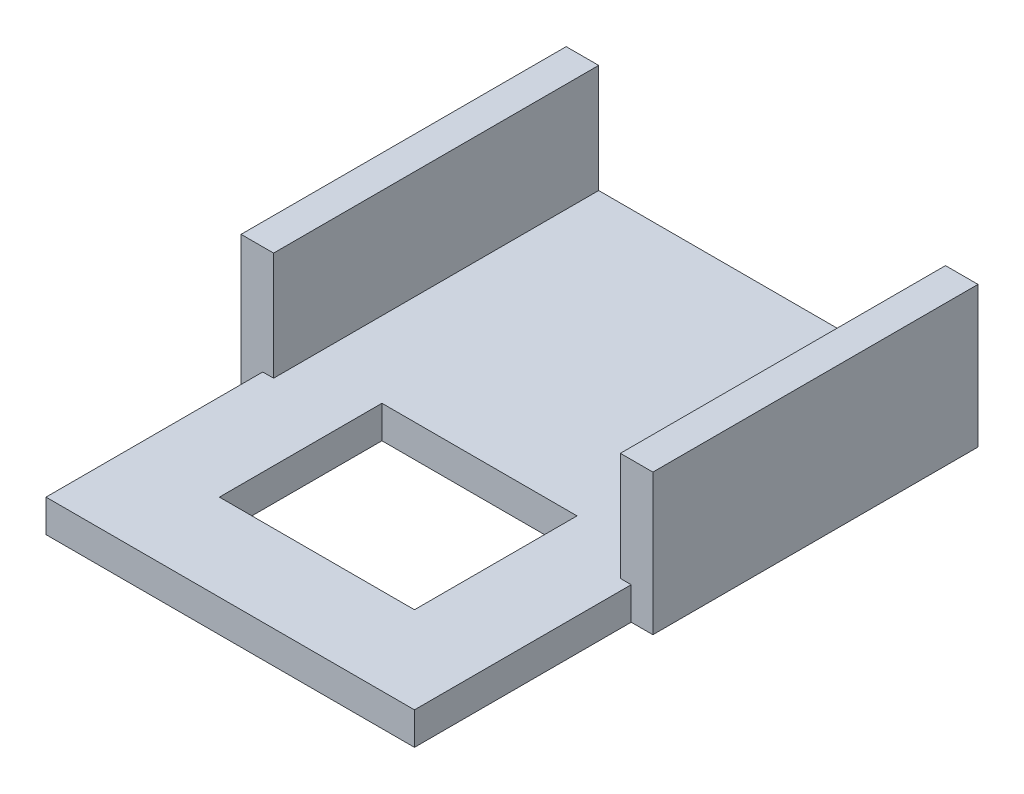
ISO-10303-21;
HEADER;
FILE_DESCRIPTION(('STEP AP214'),'2;1');
FILE_NAME('part.step','',(''),(''),'','','');
FILE_SCHEMA(('AUTOMOTIVE_DESIGN { 1 0 10303 214 1 1 1 1 }'));
ENDSEC;
DATA;
#1=APPLICATION_CONTEXT('core data for automotive mechanical design processes');
#2=APPLICATION_PROTOCOL_DEFINITION('international standard','automotive_design',2000,#1);
#3=PRODUCT_CONTEXT('',#1,'mechanical');
#4=PRODUCT('Part','Part','',(#3));
#5=PRODUCT_RELATED_PRODUCT_CATEGORY('part','',(#4));
#6=PRODUCT_DEFINITION_FORMATION('','',#4);
#7=PRODUCT_DEFINITION_CONTEXT('part definition',#1,'design');
#8=PRODUCT_DEFINITION('design','',#6,#7);
#9=PRODUCT_DEFINITION_SHAPE('','',#8);
#10=(LENGTH_UNIT() NAMED_UNIT(*) SI_UNIT(.MILLI.,.METRE.));
#11=(NAMED_UNIT(*) PLANE_ANGLE_UNIT() SI_UNIT($,.RADIAN.));
#12=(NAMED_UNIT(*) SI_UNIT($,.STERADIAN.) SOLID_ANGLE_UNIT());
#13=UNCERTAINTY_MEASURE_WITH_UNIT(LENGTH_MEASURE(1.E-05),#10,'distance_accuracy_value','');
#14=(GEOMETRIC_REPRESENTATION_CONTEXT(3) GLOBAL_UNCERTAINTY_ASSIGNED_CONTEXT((#13)) GLOBAL_UNIT_ASSIGNED_CONTEXT((#10,
#11,#12)) REPRESENTATION_CONTEXT('',''));
#15=CARTESIAN_POINT('',(0.,0.,0.));
#16=DIRECTION('',(0.,0.,1.));
#17=DIRECTION('',(1.,0.,0.));
#18=AXIS2_PLACEMENT_3D('',#15,#16,#17);
#19=CARTESIAN_POINT('',(-1.9,0.65,3.));
#20=DIRECTION('',(0.,0.,-1.));
#21=DIRECTION('',(-1.,0.,0.));
#22=AXIS2_PLACEMENT_3D('',#19,#20,#21);
#23=PLANE('',#22);
#24=DIRECTION('',(0.,-1.,0.));
#25=VECTOR('',#24,1.);
#26=CARTESIAN_POINT('',(-1.70000000000002,-0.350000000000036,3.));
#27=LINE('',#26,#25);
#28=CARTESIAN_POINT('',(-1.70000000000002,-0.350000000000036,3.));
#29=VERTEX_POINT('',#28);
#30=CARTESIAN_POINT('',(-1.70000000000001,-0.65,3.));
#31=VERTEX_POINT('',#30);
#32=EDGE_CURVE('E170',#29,#31,#27,.T.);
#33=ORIENTED_EDGE('',*,*,#32,.F.);
#34=DIRECTION('',(-1.,0.,0.));
#35=VECTOR('',#34,1.);
#36=CARTESIAN_POINT('',(1.70000000000002,-0.350000000000036,3.));
#37=LINE('',#36,#35);
#38=CARTESIAN_POINT('',(-1.60000000000002,-0.35,3.));
#39=VERTEX_POINT('',#38);
#40=EDGE_CURVE('E185',#39,#29,#37,.T.);
#41=ORIENTED_EDGE('',*,*,#40,.F.);
#42=DIRECTION('',(0.,1.,0.));
#43=VECTOR('',#42,1.);
#44=CARTESIAN_POINT('',(-1.6,0.65,3.));
#45=LINE('',#44,#43);
#46=CARTESIAN_POINT('',(-1.6,0.65,3.));
#47=VERTEX_POINT('',#46);
#48=EDGE_CURVE('E254',#39,#47,#45,.T.);
#49=ORIENTED_EDGE('',*,*,#48,.T.);
#50=DIRECTION('',(-1.,0.,0.));
#51=VECTOR('',#50,1.);
#52=CARTESIAN_POINT('',(-1.9,0.65,3.));
#53=LINE('',#52,#51);
#54=CARTESIAN_POINT('',(-1.9,0.65,3.));
#55=VERTEX_POINT('',#54);
#56=EDGE_CURVE('E253',#47,#55,#53,.T.);
#57=ORIENTED_EDGE('',*,*,#56,.T.);
#58=DIRECTION('',(0.,-1.,0.));
#59=VECTOR('',#58,1.);
#60=CARTESIAN_POINT('',(-1.9,-0.65,3.));
#61=LINE('',#60,#59);
#62=CARTESIAN_POINT('',(-1.9,-0.65,3.));
#63=VERTEX_POINT('',#62);
#64=EDGE_CURVE('E226',#55,#63,#61,.T.);
#65=ORIENTED_EDGE('',*,*,#64,.T.);
#66=DIRECTION('',(1.,0.,0.));
#67=VECTOR('',#66,1.);
#68=CARTESIAN_POINT('',(1.9,-0.65,3.));
#69=LINE('',#68,#67);
#70=EDGE_CURVE('E233',#63,#31,#69,.T.);
#71=ORIENTED_EDGE('',*,*,#70,.T.);
#72=EDGE_LOOP('',(#33,#41,#49,#57,#65,#71));
#73=FACE_BOUND('',#72,.T.);
#74=ADVANCED_FACE('F33',(#73),#23,.F.);
#75=CARTESIAN_POINT('',(1.70000000000002,-0.350000000000036,3.));
#76=VERTEX_POINT('',#75);
#77=CARTESIAN_POINT('',(1.60000000000002,-0.350000000000036,3.));
#78=VERTEX_POINT('',#77);
#79=EDGE_CURVE('E202',#76,#78,#37,.T.);
#80=ORIENTED_EDGE('',*,*,#79,.F.);
#81=DIRECTION('',(0.,1.,0.));
#82=VECTOR('',#81,1.);
#83=CARTESIAN_POINT('',(1.70000000000002,-0.350000000000036,3.));
#84=LINE('',#83,#82);
#85=CARTESIAN_POINT('',(1.70000000000001,-0.65,3.));
#86=VERTEX_POINT('',#85);
#87=EDGE_CURVE('E182',#86,#76,#84,.T.);
#88=ORIENTED_EDGE('',*,*,#87,.F.);
#89=CARTESIAN_POINT('',(1.9,-0.65,3.));
#90=VERTEX_POINT('',#89);
#91=EDGE_CURVE('E196',#86,#90,#69,.T.);
#92=ORIENTED_EDGE('',*,*,#91,.T.);
#93=DIRECTION('',(0.,1.,0.));
#94=VECTOR('',#93,1.);
#95=CARTESIAN_POINT('',(1.9,0.65,3.));
#96=LINE('',#95,#94);
#97=CARTESIAN_POINT('',(1.9,0.65,3.));
#98=VERTEX_POINT('',#97);
#99=EDGE_CURVE('E230',#90,#98,#96,.T.);
#100=ORIENTED_EDGE('',*,*,#99,.T.);
#101=DIRECTION('',(-1.,0.,0.));
#102=VECTOR('',#101,1.);
#103=CARTESIAN_POINT('',(1.9,0.65,3.));
#104=LINE('',#103,#102);
#105=CARTESIAN_POINT('',(1.6,0.65,3.));
#106=VERTEX_POINT('',#105);
#107=EDGE_CURVE('E255',#98,#106,#104,.T.);
#108=ORIENTED_EDGE('',*,*,#107,.T.);
#109=DIRECTION('',(0.,-1.,0.));
#110=VECTOR('',#109,1.);
#111=CARTESIAN_POINT('',(1.6,0.65,3.));
#112=LINE('',#111,#110);
#113=EDGE_CURVE('E256',#106,#78,#112,.T.);
#114=ORIENTED_EDGE('',*,*,#113,.T.);
#115=EDGE_LOOP('',(#80,#88,#92,#100,#108,#114));
#116=FACE_BOUND('',#115,.T.);
#117=ADVANCED_FACE('F263',(#116),#23,.F.);
#118=CARTESIAN_POINT('',(-1.9,-0.65,3.));
#119=DIRECTION('',(1.,0.,0.));
#120=DIRECTION('',(0.,0.,-1.));
#121=AXIS2_PLACEMENT_3D('',#118,#119,#120);
#122=PLANE('',#121);
#123=DIRECTION('',(0.,-1.,0.));
#124=VECTOR('',#123,1.);
#125=CARTESIAN_POINT('',(-1.9,-0.65,0.));
#126=LINE('',#125,#124);
#127=CARTESIAN_POINT('',(-1.9,0.65,0.));
#128=VERTEX_POINT('',#127);
#129=CARTESIAN_POINT('',(-1.9,-0.65,0.));
#130=VERTEX_POINT('',#129);
#131=EDGE_CURVE('E208',#128,#130,#126,.T.);
#132=ORIENTED_EDGE('',*,*,#131,.T.);
#133=DIRECTION('',(0.,0.,-1.));
#134=VECTOR('',#133,1.);
#135=CARTESIAN_POINT('',(-1.9,-0.65,3.));
#136=LINE('',#135,#134);
#137=EDGE_CURVE('E190',#63,#130,#136,.T.);
#138=ORIENTED_EDGE('',*,*,#137,.F.);
#139=ORIENTED_EDGE('',*,*,#64,.F.);
#140=DIRECTION('',(0.,0.,-1.));
#141=VECTOR('',#140,1.);
#142=CARTESIAN_POINT('',(-1.9,0.65,3.));
#143=LINE('',#142,#141);
#144=EDGE_CURVE('E250',#55,#128,#143,.T.);
#145=ORIENTED_EDGE('',*,*,#144,.T.);
#146=EDGE_LOOP('',(#132,#138,#139,#145));
#147=FACE_BOUND('',#146,.T.);
#148=ADVANCED_FACE('F35',(#147),#122,.F.);
#149=CARTESIAN_POINT('',(1.9,-0.65,3.));
#150=DIRECTION('',(0.,1.,0.));
#151=DIRECTION('',(0.,0.,1.));
#152=AXIS2_PLACEMENT_3D('',#149,#150,#151);
#153=PLANE('',#152);
#154=DIRECTION('',(0.,0.,-1.));
#155=VECTOR('',#154,1.);
#156=CARTESIAN_POINT('',(-0.9,-0.65,4.19999999999999));
#157=LINE('',#156,#155);
#158=CARTESIAN_POINT('',(-0.9,-0.65,4.19999999999999));
#159=VERTEX_POINT('',#158);
#160=CARTESIAN_POINT('',(-0.899999999999999,-0.65,2.69999999999999));
#161=VERTEX_POINT('',#160);
#162=EDGE_CURVE('E48',#159,#161,#157,.T.);
#163=ORIENTED_EDGE('',*,*,#162,.F.);
#164=DIRECTION('',(-1.,0.,0.));
#165=VECTOR('',#164,1.);
#166=CARTESIAN_POINT('',(-0.9,-0.65,4.19999999999999));
#167=LINE('',#166,#165);
#168=CARTESIAN_POINT('',(0.9,-0.65,4.19999999999999));
#169=VERTEX_POINT('',#168);
#170=EDGE_CURVE('E152',#169,#159,#167,.T.);
#171=ORIENTED_EDGE('',*,*,#170,.F.);
#172=DIRECTION('',(0.,0.,1.));
#173=VECTOR('',#172,1.);
#174=CARTESIAN_POINT('',(0.9,-0.65,4.19999999999999));
#175=LINE('',#174,#173);
#176=CARTESIAN_POINT('',(0.900000000000006,-0.65,2.69999999999996));
#177=VERTEX_POINT('',#176);
#178=EDGE_CURVE('E149',#177,#169,#175,.T.);
#179=ORIENTED_EDGE('',*,*,#178,.F.);
#180=DIRECTION('',(1.,0.,0.));
#181=VECTOR('',#180,1.);
#182=CARTESIAN_POINT('',(0.900000000000006,-0.65,2.69999999999996));
#183=LINE('',#182,#181);
#184=EDGE_CURVE('E164',#161,#177,#183,.T.);
#185=ORIENTED_EDGE('',*,*,#184,.F.);
#186=EDGE_LOOP('',(#163,#171,#179,#185));
#187=FACE_BOUND('',#186,.T.);
#188=DIRECTION('',(1.,0.,0.));
#189=VECTOR('',#188,1.);
#190=CARTESIAN_POINT('',(1.9,-0.65,0.));
#191=LINE('',#190,#189);
#192=CARTESIAN_POINT('',(1.9,-0.65,0.));
#193=VERTEX_POINT('',#192);
#194=EDGE_CURVE('E211',#130,#193,#191,.T.);
#195=ORIENTED_EDGE('',*,*,#194,.T.);
#196=DIRECTION('',(0.,0.,-1.));
#197=VECTOR('',#196,1.);
#198=CARTESIAN_POINT('',(1.9,-0.65,3.));
#199=LINE('',#198,#197);
#200=EDGE_CURVE('E237',#90,#193,#199,.T.);
#201=ORIENTED_EDGE('',*,*,#200,.F.);
#202=ORIENTED_EDGE('',*,*,#91,.F.);
#203=DIRECTION('',(0.,0.,-1.));
#204=VECTOR('',#203,1.);
#205=CARTESIAN_POINT('',(1.7,-0.65,5.));
#206=LINE('',#205,#204);
#207=CARTESIAN_POINT('',(1.7,-0.65,5.));
#208=VERTEX_POINT('',#207);
#209=EDGE_CURVE('E288',#208,#86,#206,.T.);
#210=ORIENTED_EDGE('',*,*,#209,.F.);
#211=DIRECTION('',(1.,0.,0.));
#212=VECTOR('',#211,1.);
#213=CARTESIAN_POINT('',(-1.7,-0.65,5.));
#214=LINE('',#213,#212);
#215=CARTESIAN_POINT('',(-1.7,-0.65,5.));
#216=VERTEX_POINT('',#215);
#217=EDGE_CURVE('E300',#216,#208,#214,.T.);
#218=ORIENTED_EDGE('',*,*,#217,.F.);
#219=DIRECTION('',(0.,0.,-1.));
#220=VECTOR('',#219,1.);
#221=CARTESIAN_POINT('',(-1.7,-0.65,5.));
#222=LINE('',#221,#220);
#223=EDGE_CURVE('E212',#216,#31,#222,.T.);
#224=ORIENTED_EDGE('',*,*,#223,.T.);
#225=ORIENTED_EDGE('',*,*,#70,.F.);
#226=ORIENTED_EDGE('',*,*,#137,.T.);
#227=EDGE_LOOP('',(#195,#201,#202,#210,#218,#224,#225,#226));
#228=FACE_BOUND('',#227,.T.);
#229=ADVANCED_FACE('F161',(#187,#228),#153,.F.);
#230=CARTESIAN_POINT('',(1.9,0.65,3.));
#231=DIRECTION('',(-1.,0.,0.));
#232=DIRECTION('',(0.,0.,1.));
#233=AXIS2_PLACEMENT_3D('',#230,#231,#232);
#234=PLANE('',#233);
#235=DIRECTION('',(0.,1.,0.));
#236=VECTOR('',#235,1.);
#237=CARTESIAN_POINT('',(1.9,0.65,0.));
#238=LINE('',#237,#236);
#239=CARTESIAN_POINT('',(1.9,0.65,0.));
#240=VERTEX_POINT('',#239);
#241=EDGE_CURVE('E214',#193,#240,#238,.T.);
#242=ORIENTED_EDGE('',*,*,#241,.T.);
#243=DIRECTION('',(0.,0.,-1.));
#244=VECTOR('',#243,1.);
#245=CARTESIAN_POINT('',(1.9,0.65,3.));
#246=LINE('',#245,#244);
#247=EDGE_CURVE('E240',#98,#240,#246,.T.);
#248=ORIENTED_EDGE('',*,*,#247,.F.);
#249=ORIENTED_EDGE('',*,*,#99,.F.);
#250=ORIENTED_EDGE('',*,*,#200,.T.);
#251=EDGE_LOOP('',(#242,#248,#249,#250));
#252=FACE_BOUND('',#251,.T.);
#253=ADVANCED_FACE('F267',(#252),#234,.F.);
#254=CARTESIAN_POINT('',(1.9,0.65,3.));
#255=DIRECTION('',(0.,-1.,0.));
#256=DIRECTION('',(0.,0.,-1.));
#257=AXIS2_PLACEMENT_3D('',#254,#255,#256);
#258=PLANE('',#257);
#259=DIRECTION('',(-1.,0.,0.));
#260=VECTOR('',#259,1.);
#261=CARTESIAN_POINT('',(1.9,0.65,0.));
#262=LINE('',#261,#260);
#263=CARTESIAN_POINT('',(1.6,0.65,0.));
#264=VERTEX_POINT('',#263);
#265=EDGE_CURVE('E216',#240,#264,#262,.T.);
#266=ORIENTED_EDGE('',*,*,#265,.T.);
#267=DIRECTION('',(0.,0.,-1.));
#268=VECTOR('',#267,1.);
#269=CARTESIAN_POINT('',(1.6,0.65,3.));
#270=LINE('',#269,#268);
#271=EDGE_CURVE('E243',#106,#264,#270,.T.);
#272=ORIENTED_EDGE('',*,*,#271,.F.);
#273=ORIENTED_EDGE('',*,*,#107,.F.);
#274=ORIENTED_EDGE('',*,*,#247,.T.);
#275=EDGE_LOOP('',(#266,#272,#273,#274));
#276=FACE_BOUND('',#275,.T.);
#277=ADVANCED_FACE('F271',(#276),#258,.F.);
#278=CARTESIAN_POINT('',(1.6,0.65,3.));
#279=DIRECTION('',(1.,0.,0.));
#280=DIRECTION('',(0.,1.,0.));
#281=AXIS2_PLACEMENT_3D('',#278,#279,#280);
#282=PLANE('',#281);
#283=DIRECTION('',(0.,-1.,0.));
#284=VECTOR('',#283,1.);
#285=CARTESIAN_POINT('',(1.6,0.65,0.));
#286=LINE('',#285,#284);
#287=CARTESIAN_POINT('',(1.60000000000002,-0.350000000000036,0.));
#288=VERTEX_POINT('',#287);
#289=EDGE_CURVE('E218',#264,#288,#286,.T.);
#290=ORIENTED_EDGE('',*,*,#289,.T.);
#291=DIRECTION('',(0.,0.,-1.));
#292=VECTOR('',#291,1.);
#293=CARTESIAN_POINT('',(1.60000000000002,-0.350000000000036,3.));
#294=LINE('',#293,#292);
#295=EDGE_CURVE('E246',#78,#288,#294,.T.);
#296=ORIENTED_EDGE('',*,*,#295,.F.);
#297=ORIENTED_EDGE('',*,*,#113,.F.);
#298=ORIENTED_EDGE('',*,*,#271,.T.);
#299=EDGE_LOOP('',(#290,#296,#297,#298));
#300=FACE_BOUND('',#299,.T.);
#301=ADVANCED_FACE('F276',(#300),#282,.F.);
#302=CARTESIAN_POINT('',(1.60000000000002,-0.350000000000036,3.));
#303=DIRECTION('',(0.,-1.,0.));
#304=DIRECTION('',(1.,0.,0.));
#305=AXIS2_PLACEMENT_3D('',#302,#303,#304);
#306=PLANE('',#305);
#307=DIRECTION('',(1.,0.,0.));
#308=VECTOR('',#307,1.);
#309=CARTESIAN_POINT('',(1.60000000000002,-0.350000000000036,2.69999999999995));
#310=LINE('',#309,#308);
#311=CARTESIAN_POINT('',(-0.9,-0.350000000000007,2.69999999999999));
#312=VERTEX_POINT('',#311);
#313=CARTESIAN_POINT('',(0.900000000000006,-0.350000000000018,2.69999999999996));
#314=VERTEX_POINT('',#313);
#315=EDGE_CURVE('E41',#312,#314,#310,.T.);
#316=ORIENTED_EDGE('',*,*,#315,.T.);
#317=DIRECTION('',(0.,0.,1.));
#318=VECTOR('',#317,1.);
#319=CARTESIAN_POINT('',(0.900000000000005,-0.350000000000028,3.));
#320=LINE('',#319,#318);
#321=CARTESIAN_POINT('',(0.9,-0.350000000000018,4.19999999999999));
#322=VERTEX_POINT('',#321);
#323=EDGE_CURVE('E11',#314,#322,#320,.T.);
#324=ORIENTED_EDGE('',*,*,#323,.T.);
#325=DIRECTION('',(-1.,0.,0.));
#326=VECTOR('',#325,1.);
#327=CARTESIAN_POINT('',(1.60000000000002,-0.350000000000036,4.19999999999999));
#328=LINE('',#327,#326);
#329=CARTESIAN_POINT('',(-0.9,-0.350000000000008,4.19999999999999));
#330=VERTEX_POINT('',#329);
#331=EDGE_CURVE('E189',#322,#330,#328,.T.);
#332=ORIENTED_EDGE('',*,*,#331,.T.);
#333=DIRECTION('',(0.,0.,-1.));
#334=VECTOR('',#333,1.);
#335=CARTESIAN_POINT('',(-0.9,-0.350000000000008,3.));
#336=LINE('',#335,#334);
#337=EDGE_CURVE('E146',#330,#312,#336,.T.);
#338=ORIENTED_EDGE('',*,*,#337,.T.);
#339=EDGE_LOOP('',(#316,#324,#332,#338));
#340=FACE_BOUND('',#339,.T.);
#341=DIRECTION('',(-1.,0.,0.));
#342=VECTOR('',#341,1.);
#343=CARTESIAN_POINT('',(1.60000000000002,-0.350000000000036,0.));
#344=LINE('',#343,#342);
#345=CARTESIAN_POINT('',(-1.60000000000002,-0.35,0.));
#346=VERTEX_POINT('',#345);
#347=EDGE_CURVE('E220',#288,#346,#344,.T.);
#348=ORIENTED_EDGE('',*,*,#347,.T.);
#349=DIRECTION('',(0.,0.,-1.));
#350=VECTOR('',#349,1.);
#351=CARTESIAN_POINT('',(-1.60000000000002,-0.35,3.));
#352=LINE('',#351,#350);
#353=EDGE_CURVE('E191',#39,#346,#352,.T.);
#354=ORIENTED_EDGE('',*,*,#353,.F.);
#355=ORIENTED_EDGE('',*,*,#40,.T.);
#356=DIRECTION('',(0.,0.,-1.));
#357=VECTOR('',#356,1.);
#358=CARTESIAN_POINT('',(-1.70000000000002,-0.350000000000036,5.));
#359=LINE('',#358,#357);
#360=CARTESIAN_POINT('',(-1.70000000000002,-0.350000000000036,5.));
#361=VERTEX_POINT('',#360);
#362=EDGE_CURVE('E292',#361,#29,#359,.T.);
#363=ORIENTED_EDGE('',*,*,#362,.F.);
#364=DIRECTION('',(-1.,0.,0.));
#365=VECTOR('',#364,1.);
#366=CARTESIAN_POINT('',(1.70000000000002,-0.350000000000036,5.));
#367=LINE('',#366,#365);
#368=CARTESIAN_POINT('',(1.70000000000002,-0.350000000000036,5.));
#369=VERTEX_POINT('',#368);
#370=EDGE_CURVE('E291',#369,#361,#367,.T.);
#371=ORIENTED_EDGE('',*,*,#370,.F.);
#372=DIRECTION('',(0.,0.,-1.));
#373=VECTOR('',#372,1.);
#374=CARTESIAN_POINT('',(1.70000000000002,-0.350000000000036,5.));
#375=LINE('',#374,#373);
#376=EDGE_CURVE('E206',#369,#76,#375,.T.);
#377=ORIENTED_EDGE('',*,*,#376,.T.);
#378=ORIENTED_EDGE('',*,*,#79,.T.);
#379=ORIENTED_EDGE('',*,*,#295,.T.);
#380=EDGE_LOOP('',(#348,#354,#355,#363,#371,#377,#378,#379));
#381=FACE_BOUND('',#380,.T.);
#382=ADVANCED_FACE('F289',(#340,#381),#306,.F.);
#383=CARTESIAN_POINT('',(-1.6,0.65,3.));
#384=DIRECTION('',(-1.,0.,0.));
#385=DIRECTION('',(0.,-1.,0.));
#386=AXIS2_PLACEMENT_3D('',#383,#384,#385);
#387=PLANE('',#386);
#388=DIRECTION('',(0.,1.,0.));
#389=VECTOR('',#388,1.);
#390=CARTESIAN_POINT('',(-1.6,0.65,0.));
#391=LINE('',#390,#389);
#392=CARTESIAN_POINT('',(-1.6,0.65,0.));
#393=VERTEX_POINT('',#392);
#394=EDGE_CURVE('E222',#346,#393,#391,.T.);
#395=ORIENTED_EDGE('',*,*,#394,.T.);
#396=DIRECTION('',(0.,0.,-1.));
#397=VECTOR('',#396,1.);
#398=CARTESIAN_POINT('',(-1.6,0.65,3.));
#399=LINE('',#398,#397);
#400=EDGE_CURVE('E247',#47,#393,#399,.T.);
#401=ORIENTED_EDGE('',*,*,#400,.F.);
#402=ORIENTED_EDGE('',*,*,#48,.F.);
#403=ORIENTED_EDGE('',*,*,#353,.T.);
#404=EDGE_LOOP('',(#395,#401,#402,#403));
#405=FACE_BOUND('',#404,.T.);
#406=ADVANCED_FACE('F352',(#405),#387,.F.);
#407=CARTESIAN_POINT('',(-1.9,0.65,3.));
#408=DIRECTION('',(0.,-1.,0.));
#409=DIRECTION('',(0.,0.,-1.));
#410=AXIS2_PLACEMENT_3D('',#407,#408,#409);
#411=PLANE('',#410);
#412=DIRECTION('',(-1.,0.,0.));
#413=VECTOR('',#412,1.);
#414=CARTESIAN_POINT('',(-1.9,0.65,0.));
#415=LINE('',#414,#413);
#416=EDGE_CURVE('E224',#393,#128,#415,.T.);
#417=ORIENTED_EDGE('',*,*,#416,.T.);
#418=ORIENTED_EDGE('',*,*,#144,.F.);
#419=ORIENTED_EDGE('',*,*,#56,.F.);
#420=ORIENTED_EDGE('',*,*,#400,.T.);
#421=EDGE_LOOP('',(#417,#418,#419,#420));
#422=FACE_BOUND('',#421,.T.);
#423=ADVANCED_FACE('F349',(#422),#411,.F.);
#424=CARTESIAN_POINT('',(-1.9,0.65,0.));
#425=DIRECTION('',(0.,0.,-1.));
#426=DIRECTION('',(-1.,0.,0.));
#427=AXIS2_PLACEMENT_3D('',#424,#425,#426);
#428=PLANE('',#427);
#429=ORIENTED_EDGE('',*,*,#131,.F.);
#430=ORIENTED_EDGE('',*,*,#416,.F.);
#431=ORIENTED_EDGE('',*,*,#394,.F.);
#432=ORIENTED_EDGE('',*,*,#347,.F.);
#433=ORIENTED_EDGE('',*,*,#289,.F.);
#434=ORIENTED_EDGE('',*,*,#265,.F.);
#435=ORIENTED_EDGE('',*,*,#241,.F.);
#436=ORIENTED_EDGE('',*,*,#194,.F.);
#437=EDGE_LOOP('',(#429,#430,#431,#432,#433,#434,#435,#436));
#438=FACE_BOUND('',#437,.T.);
#439=ADVANCED_FACE('F312',(#438),#428,.T.);
#440=CARTESIAN_POINT('',(-1.70000000000002,-0.350000000000036,5.));
#441=DIRECTION('',(1.,0.,0.));
#442=DIRECTION('',(0.,1.,0.));
#443=AXIS2_PLACEMENT_3D('',#440,#441,#442);
#444=PLANE('',#443);
#445=ORIENTED_EDGE('',*,*,#32,.T.);
#446=ORIENTED_EDGE('',*,*,#223,.F.);
#447=DIRECTION('',(0.,-1.,0.));
#448=VECTOR('',#447,1.);
#449=CARTESIAN_POINT('',(-1.70000000000002,-0.350000000000036,5.));
#450=LINE('',#449,#448);
#451=EDGE_CURVE('E176',#361,#216,#450,.T.);
#452=ORIENTED_EDGE('',*,*,#451,.F.);
#453=ORIENTED_EDGE('',*,*,#362,.T.);
#454=EDGE_LOOP('',(#445,#446,#452,#453));
#455=FACE_BOUND('',#454,.T.);
#456=ADVANCED_FACE('F306',(#455),#444,.F.);
#457=CARTESIAN_POINT('',(1.70000000000002,-0.350000000000036,5.));
#458=DIRECTION('',(-1.,0.,0.));
#459=DIRECTION('',(0.,-1.,0.));
#460=AXIS2_PLACEMENT_3D('',#457,#458,#459);
#461=PLANE('',#460);
#462=ORIENTED_EDGE('',*,*,#87,.T.);
#463=ORIENTED_EDGE('',*,*,#376,.F.);
#464=DIRECTION('',(0.,1.,0.));
#465=VECTOR('',#464,1.);
#466=CARTESIAN_POINT('',(1.70000000000002,-0.350000000000036,5.));
#467=LINE('',#466,#465);
#468=EDGE_CURVE('E297',#208,#369,#467,.T.);
#469=ORIENTED_EDGE('',*,*,#468,.F.);
#470=ORIENTED_EDGE('',*,*,#209,.T.);
#471=EDGE_LOOP('',(#462,#463,#469,#470));
#472=FACE_BOUND('',#471,.T.);
#473=ADVANCED_FACE('F284',(#472),#461,.F.);
#474=CARTESIAN_POINT('',(-1.70000000000002,-0.350000000000036,5.));
#475=DIRECTION('',(0.,0.,-1.));
#476=DIRECTION('',(-1.,0.,0.));
#477=AXIS2_PLACEMENT_3D('',#474,#475,#476);
#478=PLANE('',#477);
#479=ORIENTED_EDGE('',*,*,#451,.T.);
#480=ORIENTED_EDGE('',*,*,#217,.T.);
#481=ORIENTED_EDGE('',*,*,#468,.T.);
#482=ORIENTED_EDGE('',*,*,#370,.T.);
#483=EDGE_LOOP('',(#479,#480,#481,#482));
#484=FACE_BOUND('',#483,.T.);
#485=ADVANCED_FACE('F304',(#484),#478,.F.);
#486=CARTESIAN_POINT('',(0.9,1.35,4.19999999999999));
#487=DIRECTION('',(1.,0.,0.));
#488=DIRECTION('',(0.,0.,-1.));
#489=AXIS2_PLACEMENT_3D('',#486,#487,#488);
#490=PLANE('',#489);
#491=DIRECTION('',(0.,-1.,0.));
#492=VECTOR('',#491,1.);
#493=CARTESIAN_POINT('',(0.900000000000006,1.35,2.69999999999996));
#494=LINE('',#493,#492);
#495=EDGE_CURVE('E171',#314,#177,#494,.T.);
#496=ORIENTED_EDGE('',*,*,#495,.T.);
#497=ORIENTED_EDGE('',*,*,#178,.T.);
#498=DIRECTION('',(0.,-1.,0.));
#499=VECTOR('',#498,1.);
#500=CARTESIAN_POINT('',(0.9,1.35,4.19999999999999));
#501=LINE('',#500,#499);
#502=EDGE_CURVE('E155',#322,#169,#501,.T.);
#503=ORIENTED_EDGE('',*,*,#502,.F.);
#504=ORIENTED_EDGE('',*,*,#323,.F.);
#505=EDGE_LOOP('',(#496,#497,#503,#504));
#506=FACE_BOUND('',#505,.T.);
#507=ADVANCED_FACE('F330',(#506),#490,.F.);
#508=CARTESIAN_POINT('',(-0.9,1.35,4.19999999999999));
#509=DIRECTION('',(-1.,0.,0.));
#510=DIRECTION('',(0.,0.,1.));
#511=AXIS2_PLACEMENT_3D('',#508,#509,#510);
#512=PLANE('',#511);
#513=DIRECTION('',(0.,-1.,0.));
#514=VECTOR('',#513,1.);
#515=CARTESIAN_POINT('',(-0.9,1.35,4.19999999999999));
#516=LINE('',#515,#514);
#517=EDGE_CURVE('E55',#330,#159,#516,.T.);
#518=ORIENTED_EDGE('',*,*,#517,.T.);
#519=ORIENTED_EDGE('',*,*,#162,.T.);
#520=DIRECTION('',(0.,-1.,0.));
#521=VECTOR('',#520,1.);
#522=CARTESIAN_POINT('',(-0.9,1.35,2.69999999999999));
#523=LINE('',#522,#521);
#524=EDGE_CURVE('E148',#312,#161,#523,.T.);
#525=ORIENTED_EDGE('',*,*,#524,.F.);
#526=ORIENTED_EDGE('',*,*,#337,.F.);
#527=EDGE_LOOP('',(#518,#519,#525,#526));
#528=FACE_BOUND('',#527,.T.);
#529=ADVANCED_FACE('F144',(#528),#512,.F.);
#530=CARTESIAN_POINT('',(0.900000000000006,1.35,2.69999999999996));
#531=DIRECTION('',(0.,0.,-1.));
#532=DIRECTION('',(-1.,0.,0.));
#533=AXIS2_PLACEMENT_3D('',#530,#531,#532);
#534=PLANE('',#533);
#535=ORIENTED_EDGE('',*,*,#524,.T.);
#536=ORIENTED_EDGE('',*,*,#184,.T.);
#537=ORIENTED_EDGE('',*,*,#495,.F.);
#538=ORIENTED_EDGE('',*,*,#315,.F.);
#539=EDGE_LOOP('',(#535,#536,#537,#538));
#540=FACE_BOUND('',#539,.T.);
#541=ADVANCED_FACE('F328',(#540),#534,.F.);
#542=CARTESIAN_POINT('',(-0.9,1.35,4.19999999999999));
#543=DIRECTION('',(0.,0.,1.));
#544=DIRECTION('',(1.,0.,0.));
#545=AXIS2_PLACEMENT_3D('',#542,#543,#544);
#546=PLANE('',#545);
#547=ORIENTED_EDGE('',*,*,#502,.T.);
#548=ORIENTED_EDGE('',*,*,#170,.T.);
#549=ORIENTED_EDGE('',*,*,#517,.F.);
#550=ORIENTED_EDGE('',*,*,#331,.F.);
#551=EDGE_LOOP('',(#547,#548,#549,#550));
#552=FACE_BOUND('',#551,.T.);
#553=ADVANCED_FACE('F153',(#552),#546,.F.);
#554=CLOSED_SHELL('',(#74,#117,#148,#229,#253,#277,#301,#382,#406,#423,#439,#456,#473,#485,#507,
#529,#541,#553));
#555=MANIFOLD_SOLID_BREP('B2',#554);
#556=ADVANCED_BREP_SHAPE_REPRESENTATION('',(#18,#555),#14);
#557=SHAPE_DEFINITION_REPRESENTATION(#9,#556);
ENDSEC;
END-ISO-10303-21;
